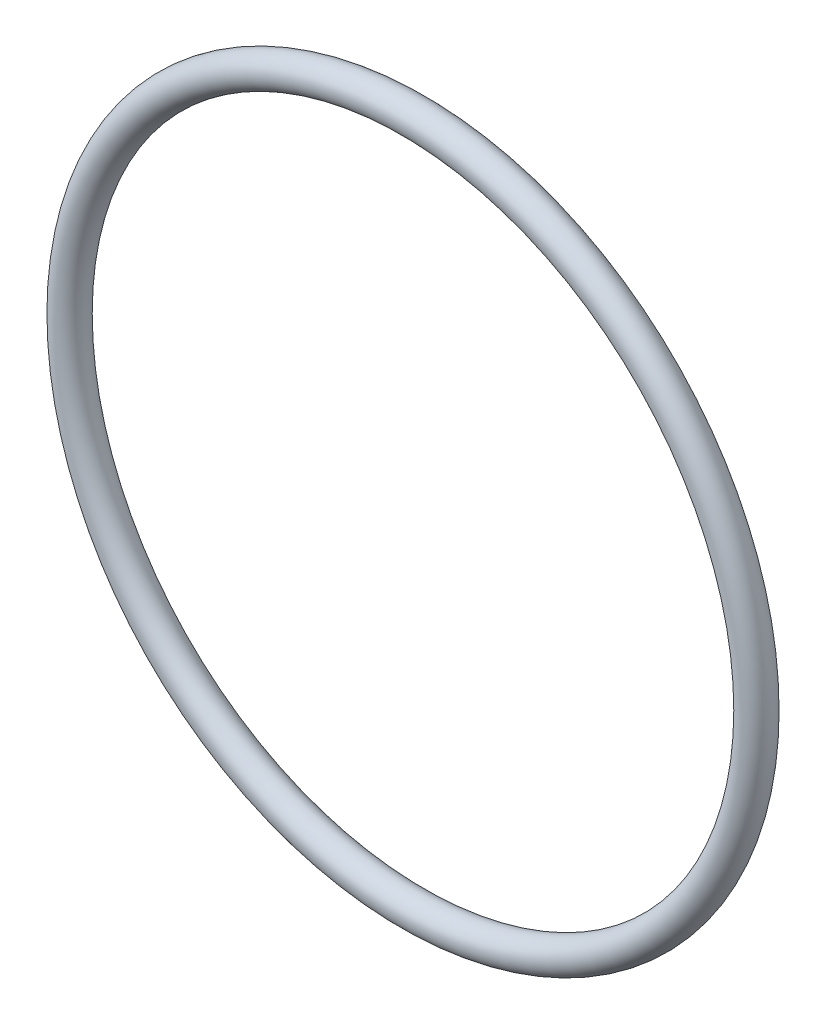
ISO-10303-21;
HEADER;
FILE_DESCRIPTION(('STEP AP214'),'2;1');
FILE_NAME('part.step','',(''),(''),'','','');
FILE_SCHEMA(('AUTOMOTIVE_DESIGN { 1 0 10303 214 1 1 1 1 }'));
ENDSEC;
DATA;
#1=APPLICATION_CONTEXT('core data for automotive mechanical design processes');
#2=APPLICATION_PROTOCOL_DEFINITION('international standard','automotive_design',2000,#1);
#3=PRODUCT_CONTEXT('',#1,'mechanical');
#4=PRODUCT('Part','Part','',(#3));
#5=PRODUCT_RELATED_PRODUCT_CATEGORY('part','',(#4));
#6=PRODUCT_DEFINITION_FORMATION('','',#4);
#7=PRODUCT_DEFINITION_CONTEXT('part definition',#1,'design');
#8=PRODUCT_DEFINITION('design','',#6,#7);
#9=PRODUCT_DEFINITION_SHAPE('','',#8);
#10=(LENGTH_UNIT() NAMED_UNIT(*) SI_UNIT(.MILLI.,.METRE.));
#11=(NAMED_UNIT(*) PLANE_ANGLE_UNIT() SI_UNIT($,.RADIAN.));
#12=(NAMED_UNIT(*) SI_UNIT($,.STERADIAN.) SOLID_ANGLE_UNIT());
#13=UNCERTAINTY_MEASURE_WITH_UNIT(LENGTH_MEASURE(1.E-05),#10,'distance_accuracy_value','');
#14=(GEOMETRIC_REPRESENTATION_CONTEXT(3) GLOBAL_UNCERTAINTY_ASSIGNED_CONTEXT((#13)) GLOBAL_UNIT_ASSIGNED_CONTEXT((#10,
#11,#12)) REPRESENTATION_CONTEXT('',''));
#15=CARTESIAN_POINT('',(0.,0.,0.));
#16=DIRECTION('',(0.,0.,1.));
#17=DIRECTION('',(1.,0.,0.));
#18=AXIS2_PLACEMENT_3D('',#15,#16,#17);
#19=CARTESIAN_POINT('',(0.,0.,0.));
#20=DIRECTION('',(0.,0.,1.));
#21=DIRECTION('',(1.,0.,0.));
#22=AXIS2_PLACEMENT_3D('',#19,#20,#21);
#23=TOROIDAL_SURFACE('',#22,15.,0.700000000000002);
#24=CARTESIAN_POINT('',(15.7,0.,0.));
#25=VERTEX_POINT('',#24);
#26=VERTEX_LOOP('',#25);
#27=FACE_BOUND('',#26,.T.);
#28=ADVANCED_FACE('F29',(#27),#23,.T.);
#29=CLOSED_SHELL('',(#28));
#30=MANIFOLD_SOLID_BREP('B2',#29);
#31=ADVANCED_BREP_SHAPE_REPRESENTATION('',(#18,#30),#14);
#32=SHAPE_DEFINITION_REPRESENTATION(#9,#31);
ENDSEC;
END-ISO-10303-21;
